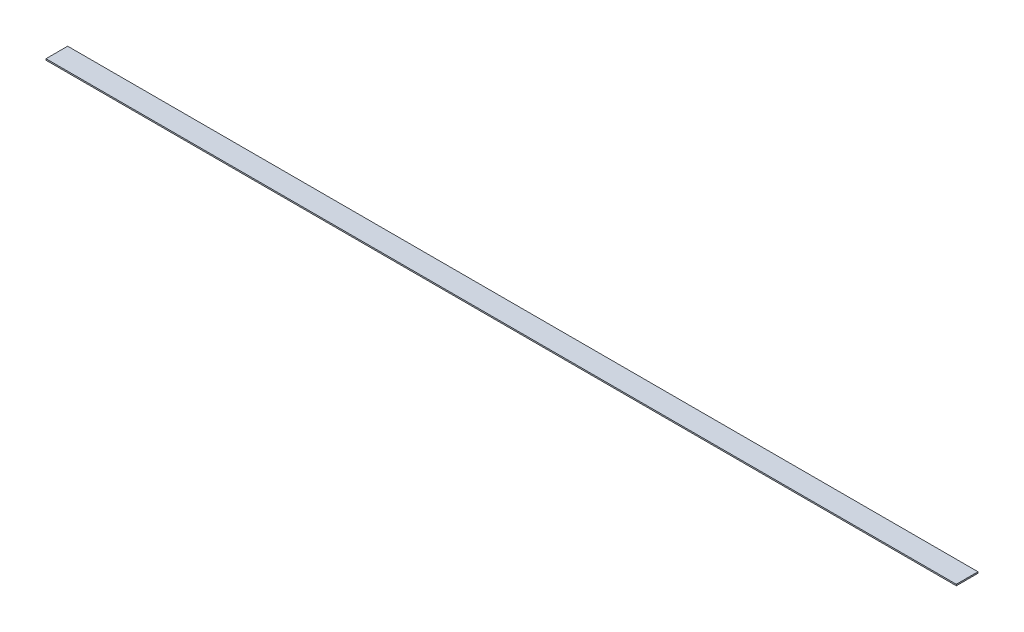
ISO-10303-21;
HEADER;
FILE_DESCRIPTION(('STEP AP214'),'2;1');
FILE_NAME('part.step','',(''),(''),'','','');
FILE_SCHEMA(('AUTOMOTIVE_DESIGN { 1 0 10303 214 1 1 1 1 }'));
ENDSEC;
DATA;
#1=APPLICATION_CONTEXT('core data for automotive mechanical design processes');
#2=APPLICATION_PROTOCOL_DEFINITION('international standard','automotive_design',2000,#1);
#3=PRODUCT_CONTEXT('',#1,'mechanical');
#4=PRODUCT('Part','Part','',(#3));
#5=PRODUCT_RELATED_PRODUCT_CATEGORY('part','',(#4));
#6=PRODUCT_DEFINITION_FORMATION('','',#4);
#7=PRODUCT_DEFINITION_CONTEXT('part definition',#1,'design');
#8=PRODUCT_DEFINITION('design','',#6,#7);
#9=PRODUCT_DEFINITION_SHAPE('','',#8);
#10=(LENGTH_UNIT() NAMED_UNIT(*) SI_UNIT(.MILLI.,.METRE.));
#11=(NAMED_UNIT(*) PLANE_ANGLE_UNIT() SI_UNIT($,.RADIAN.));
#12=(NAMED_UNIT(*) SI_UNIT($,.STERADIAN.) SOLID_ANGLE_UNIT());
#13=UNCERTAINTY_MEASURE_WITH_UNIT(LENGTH_MEASURE(1.E-05),#10,'distance_accuracy_value','');
#14=(GEOMETRIC_REPRESENTATION_CONTEXT(3) GLOBAL_UNCERTAINTY_ASSIGNED_CONTEXT((#13)) GLOBAL_UNIT_ASSIGNED_CONTEXT((#10,
#11,#12)) REPRESENTATION_CONTEXT('',''));
#15=CARTESIAN_POINT('',(0.,0.,0.));
#16=DIRECTION('',(0.,0.,1.));
#17=DIRECTION('',(1.,0.,0.));
#18=AXIS2_PLACEMENT_3D('',#15,#16,#17);
#19=CARTESIAN_POINT('',(0.,1.5875,0.));
#20=DIRECTION('',(1.,0.,0.));
#21=DIRECTION('',(0.,0.,-1.));
#22=AXIS2_PLACEMENT_3D('',#19,#20,#21);
#23=PLANE('',#22);
#24=DIRECTION('',(0.,0.,1.));
#25=VECTOR('',#24,1.);
#26=CARTESIAN_POINT('',(0.,0.,0.));
#27=LINE('',#26,#25);
#28=CARTESIAN_POINT('',(0.,0.,-25.4));
#29=VERTEX_POINT('',#28);
#30=CARTESIAN_POINT('',(0.,0.,0.));
#31=VERTEX_POINT('',#30);
#32=EDGE_CURVE('E96',#29,#31,#27,.T.);
#33=ORIENTED_EDGE('',*,*,#32,.T.);
#34=DIRECTION('',(0.,-1.,0.));
#35=VECTOR('',#34,1.);
#36=CARTESIAN_POINT('',(0.,1.5875,0.));
#37=LINE('',#36,#35);
#38=CARTESIAN_POINT('',(0.,1.5875,0.));
#39=VERTEX_POINT('',#38);
#40=EDGE_CURVE('E11',#39,#31,#37,.T.);
#41=ORIENTED_EDGE('',*,*,#40,.F.);
#42=DIRECTION('',(0.,0.,1.));
#43=VECTOR('',#42,1.);
#44=CARTESIAN_POINT('',(0.,1.5875,0.));
#45=LINE('',#44,#43);
#46=CARTESIAN_POINT('',(0.,1.5875,-25.4));
#47=VERTEX_POINT('',#46);
#48=EDGE_CURVE('E84',#47,#39,#45,.T.);
#49=ORIENTED_EDGE('',*,*,#48,.F.);
#50=DIRECTION('',(0.,-1.,0.));
#51=VECTOR('',#50,1.);
#52=CARTESIAN_POINT('',(0.,1.5875,-25.4));
#53=LINE('',#52,#51);
#54=EDGE_CURVE('E92',#47,#29,#53,.T.);
#55=ORIENTED_EDGE('',*,*,#54,.T.);
#56=EDGE_LOOP('',(#33,#41,#49,#55));
#57=FACE_BOUND('',#56,.T.);
#58=ADVANCED_FACE('F33',(#57),#23,.F.);
#59=CARTESIAN_POINT('',(0.,1.5875,0.));
#60=DIRECTION('',(0.,0.,-1.));
#61=DIRECTION('',(-1.,0.,0.));
#62=AXIS2_PLACEMENT_3D('',#59,#60,#61);
#63=PLANE('',#62);
#64=DIRECTION('',(1.,0.,0.));
#65=VECTOR('',#64,1.);
#66=CARTESIAN_POINT('',(0.,0.,0.));
#67=LINE('',#66,#65);
#68=CARTESIAN_POINT('',(1066.8,0.,0.));
#69=VERTEX_POINT('',#68);
#70=EDGE_CURVE('E88',#31,#69,#67,.T.);
#71=ORIENTED_EDGE('',*,*,#70,.T.);
#72=DIRECTION('',(0.,-1.,0.));
#73=VECTOR('',#72,1.);
#74=CARTESIAN_POINT('',(1066.8,1.5875,0.));
#75=LINE('',#74,#73);
#76=CARTESIAN_POINT('',(1066.8,1.5875,0.));
#77=VERTEX_POINT('',#76);
#78=EDGE_CURVE('E41',#77,#69,#75,.T.);
#79=ORIENTED_EDGE('',*,*,#78,.F.);
#80=DIRECTION('',(1.,0.,0.));
#81=VECTOR('',#80,1.);
#82=CARTESIAN_POINT('',(0.,1.5875,0.));
#83=LINE('',#82,#81);
#84=EDGE_CURVE('E79',#39,#77,#83,.T.);
#85=ORIENTED_EDGE('',*,*,#84,.F.);
#86=ORIENTED_EDGE('',*,*,#40,.T.);
#87=EDGE_LOOP('',(#71,#79,#85,#86));
#88=FACE_BOUND('',#87,.T.);
#89=ADVANCED_FACE('F87',(#88),#63,.F.);
#90=CARTESIAN_POINT('',(1066.8,1.5875,0.));
#91=DIRECTION('',(-1.,0.,0.));
#92=DIRECTION('',(0.,0.,1.));
#93=AXIS2_PLACEMENT_3D('',#90,#91,#92);
#94=PLANE('',#93);
#95=DIRECTION('',(0.,0.,-1.));
#96=VECTOR('',#95,1.);
#97=CARTESIAN_POINT('',(1066.8,0.,0.));
#98=LINE('',#97,#96);
#99=CARTESIAN_POINT('',(1066.8,0.,-25.4));
#100=VERTEX_POINT('',#99);
#101=EDGE_CURVE('E66',#69,#100,#98,.T.);
#102=ORIENTED_EDGE('',*,*,#101,.T.);
#103=DIRECTION('',(0.,-1.,0.));
#104=VECTOR('',#103,1.);
#105=CARTESIAN_POINT('',(1066.8,1.5875,-25.4));
#106=LINE('',#105,#104);
#107=CARTESIAN_POINT('',(1066.8,1.5875,-25.4));
#108=VERTEX_POINT('',#107);
#109=EDGE_CURVE('E89',#108,#100,#106,.T.);
#110=ORIENTED_EDGE('',*,*,#109,.F.);
#111=DIRECTION('',(0.,0.,-1.));
#112=VECTOR('',#111,1.);
#113=CARTESIAN_POINT('',(1066.8,1.5875,0.));
#114=LINE('',#113,#112);
#115=EDGE_CURVE('E82',#77,#108,#114,.T.);
#116=ORIENTED_EDGE('',*,*,#115,.F.);
#117=ORIENTED_EDGE('',*,*,#78,.T.);
#118=EDGE_LOOP('',(#102,#110,#116,#117));
#119=FACE_BOUND('',#118,.T.);
#120=ADVANCED_FACE('F90',(#119),#94,.F.);
#121=CARTESIAN_POINT('',(0.,1.5875,-25.4));
#122=DIRECTION('',(0.,0.,1.));
#123=DIRECTION('',(1.,0.,0.));
#124=AXIS2_PLACEMENT_3D('',#121,#122,#123);
#125=PLANE('',#124);
#126=DIRECTION('',(-1.,0.,0.));
#127=VECTOR('',#126,1.);
#128=CARTESIAN_POINT('',(0.,0.,-25.4));
#129=LINE('',#128,#127);
#130=EDGE_CURVE('E72',#100,#29,#129,.T.);
#131=ORIENTED_EDGE('',*,*,#130,.T.);
#132=ORIENTED_EDGE('',*,*,#54,.F.);
#133=DIRECTION('',(-1.,0.,0.));
#134=VECTOR('',#133,1.);
#135=CARTESIAN_POINT('',(0.,1.5875,-25.4));
#136=LINE('',#135,#134);
#137=EDGE_CURVE('E49',#108,#47,#136,.T.);
#138=ORIENTED_EDGE('',*,*,#137,.F.);
#139=ORIENTED_EDGE('',*,*,#109,.T.);
#140=EDGE_LOOP('',(#131,#132,#138,#139));
#141=FACE_BOUND('',#140,.T.);
#142=ADVANCED_FACE('F103',(#141),#125,.F.);
#143=CARTESIAN_POINT('',(0.,1.5875,0.));
#144=DIRECTION('',(0.,-1.,0.));
#145=DIRECTION('',(0.,0.,-1.));
#146=AXIS2_PLACEMENT_3D('',#143,#144,#145);
#147=PLANE('',#146);
#148=ORIENTED_EDGE('',*,*,#48,.T.);
#149=ORIENTED_EDGE('',*,*,#84,.T.);
#150=ORIENTED_EDGE('',*,*,#115,.T.);
#151=ORIENTED_EDGE('',*,*,#137,.T.);
#152=EDGE_LOOP('',(#148,#149,#150,#151));
#153=FACE_BOUND('',#152,.T.);
#154=ADVANCED_FACE('F80',(#153),#147,.F.);
#155=CARTESIAN_POINT('',(0.,0.,0.));
#156=DIRECTION('',(0.,-1.,0.));
#157=DIRECTION('',(0.,0.,-1.));
#158=AXIS2_PLACEMENT_3D('',#155,#156,#157);
#159=PLANE('',#158);
#160=ORIENTED_EDGE('',*,*,#32,.F.);
#161=ORIENTED_EDGE('',*,*,#130,.F.);
#162=ORIENTED_EDGE('',*,*,#101,.F.);
#163=ORIENTED_EDGE('',*,*,#70,.F.);
#164=EDGE_LOOP('',(#160,#161,#162,#163));
#165=FACE_BOUND('',#164,.T.);
#166=ADVANCED_FACE('F106',(#165),#159,.T.);
#167=CLOSED_SHELL('',(#58,#89,#120,#142,#154,#166));
#168=MANIFOLD_SOLID_BREP('B2',#167);
#169=ADVANCED_BREP_SHAPE_REPRESENTATION('',(#18,#168),#14);
#170=SHAPE_DEFINITION_REPRESENTATION(#9,#169);
ENDSEC;
END-ISO-10303-21;
